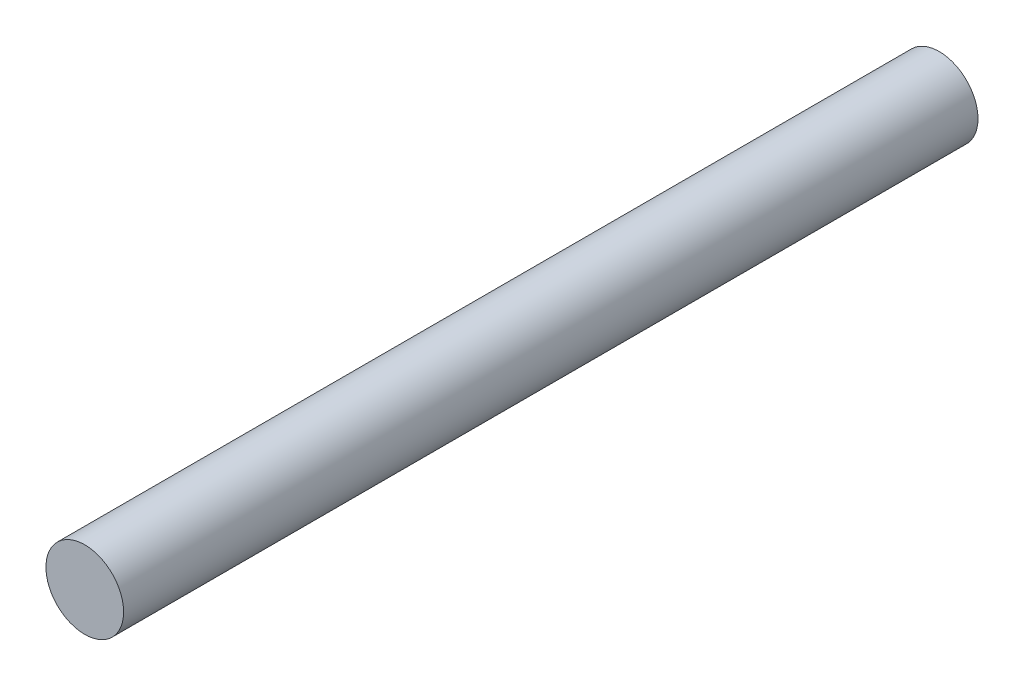
ISO-10303-21;
HEADER;
FILE_DESCRIPTION(('STEP AP214'),'2;1');
FILE_NAME('part.step','',(''),(''),'','','');
FILE_SCHEMA(('AUTOMOTIVE_DESIGN { 1 0 10303 214 1 1 1 1 }'));
ENDSEC;
DATA;
#1=APPLICATION_CONTEXT('core data for automotive mechanical design processes');
#2=APPLICATION_PROTOCOL_DEFINITION('international standard','automotive_design',2000,#1);
#3=PRODUCT_CONTEXT('',#1,'mechanical');
#4=PRODUCT('Part','Part','',(#3));
#5=PRODUCT_RELATED_PRODUCT_CATEGORY('part','',(#4));
#6=PRODUCT_DEFINITION_FORMATION('','',#4);
#7=PRODUCT_DEFINITION_CONTEXT('part definition',#1,'design');
#8=PRODUCT_DEFINITION('design','',#6,#7);
#9=PRODUCT_DEFINITION_SHAPE('','',#8);
#10=(LENGTH_UNIT() NAMED_UNIT(*) SI_UNIT(.MILLI.,.METRE.));
#11=(NAMED_UNIT(*) PLANE_ANGLE_UNIT() SI_UNIT($,.RADIAN.));
#12=(NAMED_UNIT(*) SI_UNIT($,.STERADIAN.) SOLID_ANGLE_UNIT());
#13=UNCERTAINTY_MEASURE_WITH_UNIT(LENGTH_MEASURE(1.E-05),#10,'distance_accuracy_value','');
#14=(GEOMETRIC_REPRESENTATION_CONTEXT(3) GLOBAL_UNCERTAINTY_ASSIGNED_CONTEXT((#13)) GLOBAL_UNIT_ASSIGNED_CONTEXT((#10,
#11,#12)) REPRESENTATION_CONTEXT('',''));
#15=CARTESIAN_POINT('',(0.,0.,0.));
#16=DIRECTION('',(0.,0.,1.));
#17=DIRECTION('',(1.,0.,0.));
#18=AXIS2_PLACEMENT_3D('',#15,#16,#17);
#19=CARTESIAN_POINT('',(0.,0.,-55.));
#20=DIRECTION('',(0.,0.,1.));
#21=DIRECTION('',(1.,0.,0.));
#22=AXIS2_PLACEMENT_3D('',#19,#20,#21);
#23=CYLINDRICAL_SURFACE('',#22,2.5);
#24=CARTESIAN_POINT('',(0.,0.,-55.));
#25=DIRECTION('',(0.,0.,1.));
#26=DIRECTION('',(1.,0.,0.));
#27=AXIS2_PLACEMENT_3D('',#24,#25,#26);
#28=CIRCLE('',#27,2.5);
#29=CARTESIAN_POINT('',(2.5,0.,-55.));
#30=VERTEX_POINT('',#29);
#31=EDGE_CURVE('E10',#30,#30,#28,.T.);
#32=ORIENTED_EDGE('',*,*,#31,.T.);
#33=EDGE_LOOP('',(#32));
#34=FACE_BOUND('',#33,.T.);
#35=CARTESIAN_POINT('',(0.,0.,0.));
#36=DIRECTION('',(0.,0.,1.));
#37=DIRECTION('',(1.,0.,0.));
#38=AXIS2_PLACEMENT_3D('',#35,#36,#37);
#39=CIRCLE('',#38,2.5);
#40=CARTESIAN_POINT('',(2.5,0.,0.));
#41=VERTEX_POINT('',#40);
#42=EDGE_CURVE('E34',#41,#41,#39,.T.);
#43=ORIENTED_EDGE('',*,*,#42,.F.);
#44=EDGE_LOOP('',(#43));
#45=FACE_BOUND('',#44,.T.);
#46=ADVANCED_FACE('F31',(#34,#45),#23,.T.);
#47=CARTESIAN_POINT('',(0.,0.,-55.));
#48=DIRECTION('',(0.,0.,1.));
#49=DIRECTION('',(1.,0.,0.));
#50=AXIS2_PLACEMENT_3D('',#47,#48,#49);
#51=PLANE('',#50);
#52=ORIENTED_EDGE('',*,*,#31,.F.);
#53=EDGE_LOOP('',(#52));
#54=FACE_BOUND('',#53,.T.);
#55=ADVANCED_FACE('F46',(#54),#51,.F.);
#56=CARTESIAN_POINT('',(0.,0.,0.));
#57=DIRECTION('',(0.,0.,1.));
#58=DIRECTION('',(1.,0.,0.));
#59=AXIS2_PLACEMENT_3D('',#56,#57,#58);
#60=PLANE('',#59);
#61=ORIENTED_EDGE('',*,*,#42,.T.);
#62=EDGE_LOOP('',(#61));
#63=FACE_BOUND('',#62,.T.);
#64=ADVANCED_FACE('F43',(#63),#60,.T.);
#65=CLOSED_SHELL('',(#46,#55,#64));
#66=MANIFOLD_SOLID_BREP('B2',#65);
#67=ADVANCED_BREP_SHAPE_REPRESENTATION('',(#18,#66),#14);
#68=SHAPE_DEFINITION_REPRESENTATION(#9,#67);
ENDSEC;
END-ISO-10303-21;
